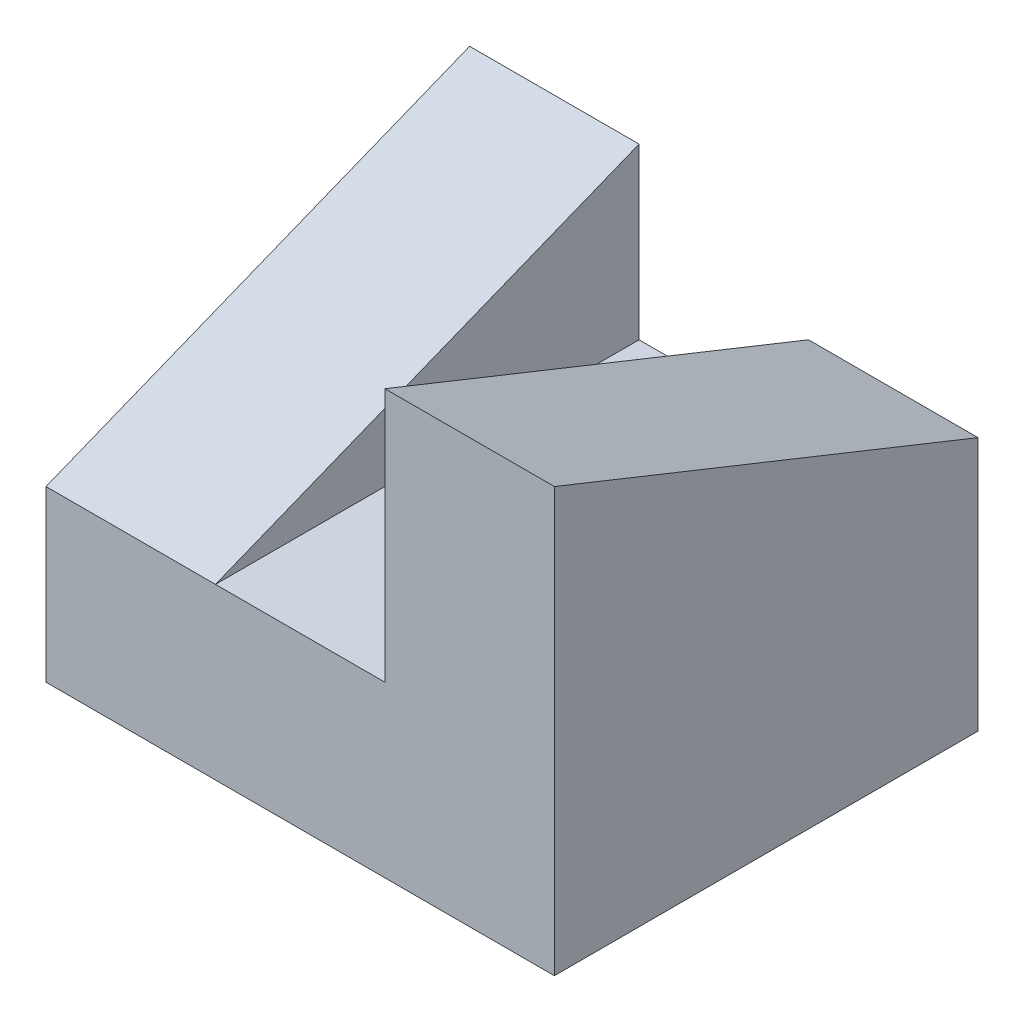
ISO-10303-21;
HEADER;
FILE_DESCRIPTION(('STEP AP214'),'2;1');
FILE_NAME('part.step','',(''),(''),'','','');
FILE_SCHEMA(('AUTOMOTIVE_DESIGN { 1 0 10303 214 1 1 1 1 }'));
ENDSEC;
DATA;
#1=APPLICATION_CONTEXT('core data for automotive mechanical design processes');
#2=APPLICATION_PROTOCOL_DEFINITION('international standard','automotive_design',2000,#1);
#3=PRODUCT_CONTEXT('',#1,'mechanical');
#4=PRODUCT('Part','Part','',(#3));
#5=PRODUCT_RELATED_PRODUCT_CATEGORY('part','',(#4));
#6=PRODUCT_DEFINITION_FORMATION('','',#4);
#7=PRODUCT_DEFINITION_CONTEXT('part definition',#1,'design');
#8=PRODUCT_DEFINITION('design','',#6,#7);
#9=PRODUCT_DEFINITION_SHAPE('','',#8);
#10=(LENGTH_UNIT() NAMED_UNIT(*) SI_UNIT(.MILLI.,.METRE.));
#11=(NAMED_UNIT(*) PLANE_ANGLE_UNIT() SI_UNIT($,.RADIAN.));
#12=(NAMED_UNIT(*) SI_UNIT($,.STERADIAN.) SOLID_ANGLE_UNIT());
#13=UNCERTAINTY_MEASURE_WITH_UNIT(LENGTH_MEASURE(1.E-05),#10,'distance_accuracy_value','');
#14=(GEOMETRIC_REPRESENTATION_CONTEXT(3) GLOBAL_UNCERTAINTY_ASSIGNED_CONTEXT((#13)) GLOBAL_UNIT_ASSIGNED_CONTEXT((#10,
#11,#12)) REPRESENTATION_CONTEXT('',''));
#15=CARTESIAN_POINT('',(0.,0.,0.));
#16=DIRECTION('',(0.,0.,1.));
#17=DIRECTION('',(1.,0.,0.));
#18=AXIS2_PLACEMENT_3D('',#15,#16,#17);
#19=CARTESIAN_POINT('',(-30.,0.,25.));
#20=DIRECTION('',(1.,0.,0.));
#21=DIRECTION('',(0.,1.,0.));
#22=AXIS2_PLACEMENT_3D('',#19,#20,#21);
#23=PLANE('',#22);
#24=DIRECTION('',(0.,-1.,0.));
#25=VECTOR('',#24,1.);
#26=CARTESIAN_POINT('',(-30.,0.,0.));
#27=LINE('',#26,#25);
#28=CARTESIAN_POINT('',(-30.,20.,0.));
#29=VERTEX_POINT('',#28);
#30=CARTESIAN_POINT('',(-30.,0.,0.));
#31=VERTEX_POINT('',#30);
#32=EDGE_CURVE('E134',#29,#31,#27,.T.);
#33=ORIENTED_EDGE('',*,*,#32,.T.);
#34=DIRECTION('',(0.,0.,-1.));
#35=VECTOR('',#34,1.);
#36=CARTESIAN_POINT('',(-30.,0.,25.));
#37=LINE('',#36,#35);
#38=CARTESIAN_POINT('',(-30.,0.,25.));
#39=VERTEX_POINT('',#38);
#40=EDGE_CURVE('E11',#39,#31,#37,.T.);
#41=ORIENTED_EDGE('',*,*,#40,.F.);
#42=DIRECTION('',(0.,-1.,0.));
#43=VECTOR('',#42,1.);
#44=CARTESIAN_POINT('',(-30.,0.,25.));
#45=LINE('',#44,#43);
#46=CARTESIAN_POINT('',(-30.,10.,25.));
#47=VERTEX_POINT('',#46);
#48=EDGE_CURVE('E136',#47,#39,#45,.T.);
#49=ORIENTED_EDGE('',*,*,#48,.F.);
#50=DIRECTION('',(0.,0.371390676354104,-0.928476690885259));
#51=VECTOR('',#50,1.);
#52=CARTESIAN_POINT('',(-30.,20.,0.));
#53=LINE('',#52,#51);
#54=EDGE_CURVE('E118',#47,#29,#53,.T.);
#55=ORIENTED_EDGE('',*,*,#54,.T.);
#56=EDGE_LOOP('',(#33,#41,#49,#55));
#57=FACE_BOUND('',#56,.T.);
#58=ADVANCED_FACE('F33',(#57),#23,.F.);
#59=CARTESIAN_POINT('',(0.,0.,25.));
#60=DIRECTION('',(0.,1.,0.));
#61=DIRECTION('',(-1.,0.,0.));
#62=AXIS2_PLACEMENT_3D('',#59,#60,#61);
#63=PLANE('',#62);
#64=DIRECTION('',(1.,0.,0.));
#65=VECTOR('',#64,1.);
#66=CARTESIAN_POINT('',(0.,0.,0.));
#67=LINE('',#66,#65);
#68=CARTESIAN_POINT('',(0.,0.,0.));
#69=VERTEX_POINT('',#68);
#70=EDGE_CURVE('E149',#31,#69,#67,.T.);
#71=ORIENTED_EDGE('',*,*,#70,.T.);
#72=DIRECTION('',(0.,0.,-1.));
#73=VECTOR('',#72,1.);
#74=CARTESIAN_POINT('',(0.,0.,25.));
#75=LINE('',#74,#73);
#76=CARTESIAN_POINT('',(0.,0.,25.));
#77=VERTEX_POINT('',#76);
#78=EDGE_CURVE('E40',#77,#69,#75,.T.);
#79=ORIENTED_EDGE('',*,*,#78,.F.);
#80=DIRECTION('',(1.,0.,0.));
#81=VECTOR('',#80,1.);
#82=CARTESIAN_POINT('',(0.,0.,25.));
#83=LINE('',#82,#81);
#84=EDGE_CURVE('E139',#39,#77,#83,.T.);
#85=ORIENTED_EDGE('',*,*,#84,.F.);
#86=ORIENTED_EDGE('',*,*,#40,.T.);
#87=EDGE_LOOP('',(#71,#79,#85,#86));
#88=FACE_BOUND('',#87,.T.);
#89=ADVANCED_FACE('F160',(#88),#63,.F.);
#90=CARTESIAN_POINT('',(0.,15.,25.));
#91=DIRECTION('',(-1.,0.,0.));
#92=DIRECTION('',(0.,0.,1.));
#93=AXIS2_PLACEMENT_3D('',#90,#91,#92);
#94=PLANE('',#93);
#95=DIRECTION('',(0.,1.,0.));
#96=VECTOR('',#95,1.);
#97=CARTESIAN_POINT('',(0.,15.,0.));
#98=LINE('',#97,#96);
#99=CARTESIAN_POINT('',(0.,15.,0.));
#100=VERTEX_POINT('',#99);
#101=EDGE_CURVE('E111',#69,#100,#98,.T.);
#102=ORIENTED_EDGE('',*,*,#101,.T.);
#103=DIRECTION('',(0.,0.371390676354104,0.928476690885259));
#104=VECTOR('',#103,1.);
#105=CARTESIAN_POINT('',(0.,25.,25.));
#106=LINE('',#105,#104);
#107=CARTESIAN_POINT('',(0.,25.,25.));
#108=VERTEX_POINT('',#107);
#109=EDGE_CURVE('E110',#100,#108,#106,.T.);
#110=ORIENTED_EDGE('',*,*,#109,.T.);
#111=DIRECTION('',(0.,1.,0.));
#112=VECTOR('',#111,1.);
#113=CARTESIAN_POINT('',(0.,15.,25.));
#114=LINE('',#113,#112);
#115=EDGE_CURVE('E141',#77,#108,#114,.T.);
#116=ORIENTED_EDGE('',*,*,#115,.F.);
#117=ORIENTED_EDGE('',*,*,#78,.T.);
#118=EDGE_LOOP('',(#102,#110,#116,#117));
#119=FACE_BOUND('',#118,.T.);
#120=ADVANCED_FACE('F157',(#119),#94,.F.);
#121=CARTESIAN_POINT('',(-10.,10.,25.));
#122=DIRECTION('',(1.,0.,0.));
#123=DIRECTION('',(0.,0.,-1.));
#124=AXIS2_PLACEMENT_3D('',#121,#122,#123);
#125=PLANE('',#124);
#126=DIRECTION('',(0.,-1.,0.));
#127=VECTOR('',#126,1.);
#128=CARTESIAN_POINT('',(-10.,10.,0.));
#129=LINE('',#128,#127);
#130=CARTESIAN_POINT('',(-10.,15.,0.));
#131=VERTEX_POINT('',#130);
#132=CARTESIAN_POINT('',(-10.,10.,0.));
#133=VERTEX_POINT('',#132);
#134=EDGE_CURVE('E93',#131,#133,#129,.T.);
#135=ORIENTED_EDGE('',*,*,#134,.T.);
#136=DIRECTION('',(0.,0.,-1.));
#137=VECTOR('',#136,1.);
#138=CARTESIAN_POINT('',(-10.,10.,25.));
#139=LINE('',#138,#137);
#140=CARTESIAN_POINT('',(-10.,10.,25.));
#141=VERTEX_POINT('',#140);
#142=EDGE_CURVE('E146',#141,#133,#139,.T.);
#143=ORIENTED_EDGE('',*,*,#142,.F.);
#144=DIRECTION('',(0.,-1.,0.));
#145=VECTOR('',#144,1.);
#146=CARTESIAN_POINT('',(-10.,10.,25.));
#147=LINE('',#146,#145);
#148=CARTESIAN_POINT('',(-10.,25.,25.));
#149=VERTEX_POINT('',#148);
#150=EDGE_CURVE('E114',#149,#141,#147,.T.);
#151=ORIENTED_EDGE('',*,*,#150,.F.);
#152=DIRECTION('',(0.,0.371390676354104,0.928476690885259));
#153=VECTOR('',#152,1.);
#154=CARTESIAN_POINT('',(-10.,25.,25.));
#155=LINE('',#154,#153);
#156=EDGE_CURVE('E108',#131,#149,#155,.T.);
#157=ORIENTED_EDGE('',*,*,#156,.F.);
#158=EDGE_LOOP('',(#135,#143,#151,#157));
#159=FACE_BOUND('',#158,.T.);
#160=ADVANCED_FACE('F113',(#159),#125,.F.);
#161=CARTESIAN_POINT('',(-30.,10.,25.));
#162=DIRECTION('',(0.,-1.,0.));
#163=DIRECTION('',(0.,0.,-1.));
#164=AXIS2_PLACEMENT_3D('',#161,#162,#163);
#165=PLANE('',#164);
#166=DIRECTION('',(-1.,0.,0.));
#167=VECTOR('',#166,1.);
#168=CARTESIAN_POINT('',(-30.,10.,0.));
#169=LINE('',#168,#167);
#170=CARTESIAN_POINT('',(-20.,10.,0.));
#171=VERTEX_POINT('',#170);
#172=EDGE_CURVE('E52',#133,#171,#169,.T.);
#173=ORIENTED_EDGE('',*,*,#172,.T.);
#174=DIRECTION('',(0.,0.,1.));
#175=VECTOR('',#174,1.);
#176=CARTESIAN_POINT('',(-20.,9.99999999999999,25.));
#177=LINE('',#176,#175);
#178=CARTESIAN_POINT('',(-20.,10.,25.));
#179=VERTEX_POINT('',#178);
#180=EDGE_CURVE('E47',#171,#179,#177,.T.);
#181=ORIENTED_EDGE('',*,*,#180,.T.);
#182=DIRECTION('',(-1.,0.,0.));
#183=VECTOR('',#182,1.);
#184=CARTESIAN_POINT('',(-30.,10.,25.));
#185=LINE('',#184,#183);
#186=EDGE_CURVE('E144',#141,#179,#185,.T.);
#187=ORIENTED_EDGE('',*,*,#186,.F.);
#188=ORIENTED_EDGE('',*,*,#142,.T.);
#189=EDGE_LOOP('',(#173,#181,#187,#188));
#190=FACE_BOUND('',#189,.T.);
#191=ADVANCED_FACE('F190',(#190),#165,.F.);
#192=CARTESIAN_POINT('',(0.,0.,25.));
#193=DIRECTION('',(0.,0.,-1.));
#194=DIRECTION('',(-1.,0.,0.));
#195=AXIS2_PLACEMENT_3D('',#192,#193,#194);
#196=PLANE('',#195);
#197=ORIENTED_EDGE('',*,*,#48,.T.);
#198=ORIENTED_EDGE('',*,*,#84,.T.);
#199=ORIENTED_EDGE('',*,*,#115,.T.);
#200=DIRECTION('',(1.,0.,0.));
#201=VECTOR('',#200,1.);
#202=CARTESIAN_POINT('',(-10.,25.,25.));
#203=LINE('',#202,#201);
#204=EDGE_CURVE('E116',#149,#108,#203,.T.);
#205=ORIENTED_EDGE('',*,*,#204,.F.);
#206=ORIENTED_EDGE('',*,*,#150,.T.);
#207=ORIENTED_EDGE('',*,*,#186,.T.);
#208=DIRECTION('',(-1.,0.,0.));
#209=VECTOR('',#208,1.);
#210=CARTESIAN_POINT('',(-20.,9.99999999999999,25.));
#211=LINE('',#210,#209);
#212=EDGE_CURVE('E128',#179,#47,#211,.T.);
#213=ORIENTED_EDGE('',*,*,#212,.T.);
#214=EDGE_LOOP('',(#197,#198,#199,#205,#206,#207,#213));
#215=FACE_BOUND('',#214,.T.);
#216=ADVANCED_FACE('F193',(#215),#196,.F.);
#217=CARTESIAN_POINT('',(0.,0.,0.));
#218=DIRECTION('',(0.,0.,-1.));
#219=DIRECTION('',(-1.,0.,0.));
#220=AXIS2_PLACEMENT_3D('',#217,#218,#219);
#221=PLANE('',#220);
#222=ORIENTED_EDGE('',*,*,#32,.F.);
#223=DIRECTION('',(-1.,0.,0.));
#224=VECTOR('',#223,1.);
#225=CARTESIAN_POINT('',(-20.,20.,0.));
#226=LINE('',#225,#224);
#227=CARTESIAN_POINT('',(-20.,20.,0.));
#228=VERTEX_POINT('',#227);
#229=EDGE_CURVE('E131',#228,#29,#226,.T.);
#230=ORIENTED_EDGE('',*,*,#229,.F.);
#231=DIRECTION('',(0.,-1.,0.));
#232=VECTOR('',#231,1.);
#233=CARTESIAN_POINT('',(-20.,9.99999999999999,0.));
#234=LINE('',#233,#232);
#235=EDGE_CURVE('E126',#228,#171,#234,.T.);
#236=ORIENTED_EDGE('',*,*,#235,.T.);
#237=ORIENTED_EDGE('',*,*,#172,.F.);
#238=ORIENTED_EDGE('',*,*,#134,.F.);
#239=DIRECTION('',(-1.,0.,0.));
#240=VECTOR('',#239,1.);
#241=CARTESIAN_POINT('',(-10.,15.,0.));
#242=LINE('',#241,#240);
#243=EDGE_CURVE('E97',#100,#131,#242,.T.);
#244=ORIENTED_EDGE('',*,*,#243,.F.);
#245=ORIENTED_EDGE('',*,*,#101,.F.);
#246=ORIENTED_EDGE('',*,*,#70,.F.);
#247=EDGE_LOOP('',(#222,#230,#236,#237,#238,#244,#245,#246));
#248=FACE_BOUND('',#247,.T.);
#249=ADVANCED_FACE('F95',(#248),#221,.T.);
#250=CARTESIAN_POINT('',(-20.,20.,0.));
#251=DIRECTION('',(0.,0.928476690885259,0.371390676354104));
#252=DIRECTION('',(0.,-0.371390676354104,0.928476690885259));
#253=AXIS2_PLACEMENT_3D('',#250,#251,#252);
#254=PLANE('',#253);
#255=ORIENTED_EDGE('',*,*,#54,.F.);
#256=ORIENTED_EDGE('',*,*,#212,.F.);
#257=DIRECTION('',(0.,0.371390676354104,-0.928476690885259));
#258=VECTOR('',#257,1.);
#259=CARTESIAN_POINT('',(-20.,20.,0.));
#260=LINE('',#259,#258);
#261=EDGE_CURVE('E123',#179,#228,#260,.T.);
#262=ORIENTED_EDGE('',*,*,#261,.T.);
#263=ORIENTED_EDGE('',*,*,#229,.T.);
#264=EDGE_LOOP('',(#255,#256,#262,#263));
#265=FACE_BOUND('',#264,.T.);
#266=ADVANCED_FACE('F166',(#265),#254,.T.);
#267=CARTESIAN_POINT('',(-20.,0.,0.));
#268=DIRECTION('',(1.,0.,0.));
#269=DIRECTION('',(0.,1.,0.));
#270=AXIS2_PLACEMENT_3D('',#267,#268,#269);
#271=PLANE('',#270);
#272=ORIENTED_EDGE('',*,*,#180,.F.);
#273=ORIENTED_EDGE('',*,*,#235,.F.);
#274=ORIENTED_EDGE('',*,*,#261,.F.);
#275=EDGE_LOOP('',(#272,#273,#274));
#276=FACE_BOUND('',#275,.T.);
#277=ADVANCED_FACE('F170',(#276),#271,.T.);
#278=CARTESIAN_POINT('',(-10.,25.,25.));
#279=DIRECTION('',(0.,0.928476690885259,-0.371390676354104));
#280=DIRECTION('',(0.,0.371390676354104,0.928476690885259));
#281=AXIS2_PLACEMENT_3D('',#278,#279,#280);
#282=PLANE('',#281);
#283=ORIENTED_EDGE('',*,*,#109,.F.);
#284=ORIENTED_EDGE('',*,*,#243,.T.);
#285=ORIENTED_EDGE('',*,*,#156,.T.);
#286=ORIENTED_EDGE('',*,*,#204,.T.);
#287=EDGE_LOOP('',(#283,#284,#285,#286));
#288=FACE_BOUND('',#287,.T.);
#289=ADVANCED_FACE('F106',(#288),#282,.T.);
#290=CLOSED_SHELL('',(#58,#89,#120,#160,#191,#216,#249,#266,#277,#289));
#291=MANIFOLD_SOLID_BREP('B2',#290);
#292=ADVANCED_BREP_SHAPE_REPRESENTATION('',(#18,#291),#14);
#293=SHAPE_DEFINITION_REPRESENTATION(#9,#292);
ENDSEC;
END-ISO-10303-21;
